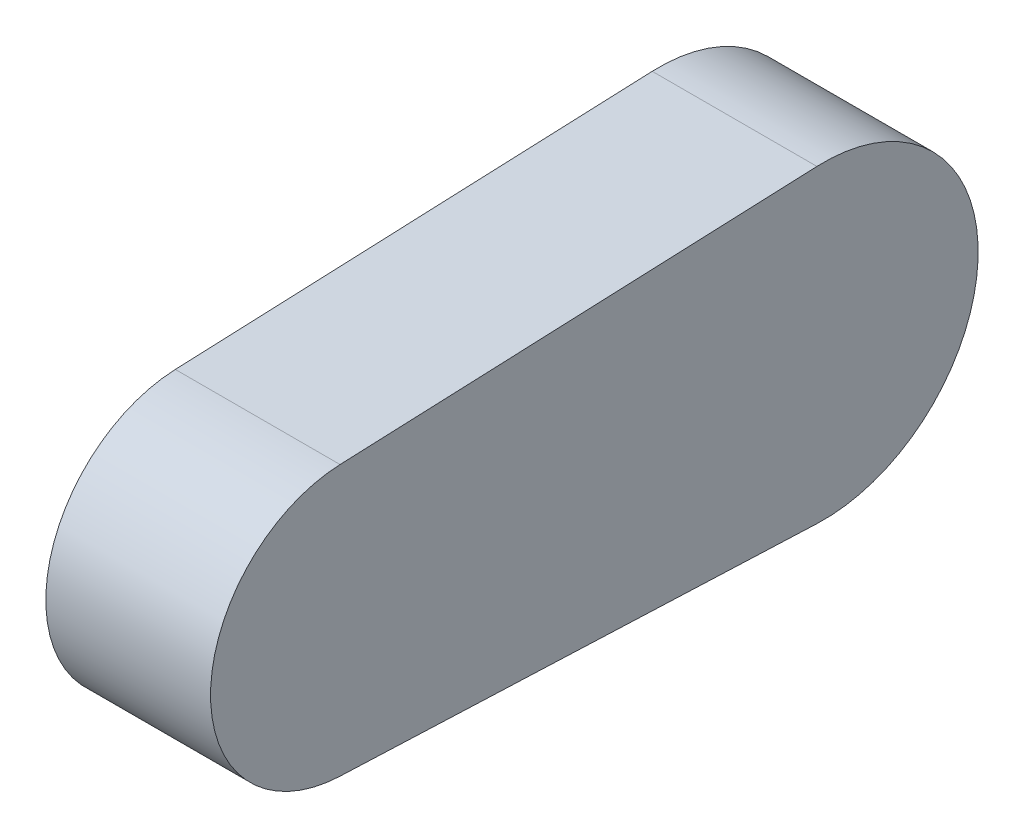
ISO-10303-21;
HEADER;
FILE_DESCRIPTION(('STEP AP214'),'2;1');
FILE_NAME('part.step','',(''),(''),'','','');
FILE_SCHEMA(('AUTOMOTIVE_DESIGN { 1 0 10303 214 1 1 1 1 }'));
ENDSEC;
DATA;
#1=APPLICATION_CONTEXT('core data for automotive mechanical design processes');
#2=APPLICATION_PROTOCOL_DEFINITION('international standard','automotive_design',2000,#1);
#3=PRODUCT_CONTEXT('',#1,'mechanical');
#4=PRODUCT('Part','Part','',(#3));
#5=PRODUCT_RELATED_PRODUCT_CATEGORY('part','',(#4));
#6=PRODUCT_DEFINITION_FORMATION('','',#4);
#7=PRODUCT_DEFINITION_CONTEXT('part definition',#1,'design');
#8=PRODUCT_DEFINITION('design','',#6,#7);
#9=PRODUCT_DEFINITION_SHAPE('','',#8);
#10=(LENGTH_UNIT() NAMED_UNIT(*) SI_UNIT(.MILLI.,.METRE.));
#11=(NAMED_UNIT(*) PLANE_ANGLE_UNIT() SI_UNIT($,.RADIAN.));
#12=(NAMED_UNIT(*) SI_UNIT($,.STERADIAN.) SOLID_ANGLE_UNIT());
#13=UNCERTAINTY_MEASURE_WITH_UNIT(LENGTH_MEASURE(1.E-05),#10,'distance_accuracy_value','');
#14=(GEOMETRIC_REPRESENTATION_CONTEXT(3) GLOBAL_UNCERTAINTY_ASSIGNED_CONTEXT((#13)) GLOBAL_UNIT_ASSIGNED_CONTEXT((#10,
#11,#12)) REPRESENTATION_CONTEXT('',''));
#15=CARTESIAN_POINT('',(0.,0.,0.));
#16=DIRECTION('',(0.,0.,1.));
#17=DIRECTION('',(1.,0.,0.));
#18=AXIS2_PLACEMENT_3D('',#15,#16,#17);
#19=CARTESIAN_POINT('',(197.5,-5.32213162429684E-12,631.));
#20=DIRECTION('',(-1.,0.,0.));
#21=DIRECTION('',(0.,0.,1.));
#22=AXIS2_PLACEMENT_3D('',#19,#20,#21);
#23=CYLINDRICAL_SURFACE('',#22,82.);
#24=CARTESIAN_POINT('',(97.5,-5.32213162429684E-12,631.));
#25=DIRECTION('',(1.,0.,0.));
#26=DIRECTION('',(0.,0.,-1.));
#27=AXIS2_PLACEMENT_3D('',#24,#25,#26);
#28=CIRCLE('',#27,82.);
#29=CARTESIAN_POINT('',(97.5,81.9297677830793,634.393103448276));
#30=VERTEX_POINT('',#29);
#31=CARTESIAN_POINT('',(97.5,-81.9297677830793,634.393103448276));
#32=VERTEX_POINT('',#31);
#33=EDGE_CURVE('E104',#30,#32,#28,.T.);
#34=ORIENTED_EDGE('',*,*,#33,.T.);
#35=DIRECTION('',(-1.,0.,0.));
#36=VECTOR('',#35,1.);
#37=CARTESIAN_POINT('',(197.5,-81.9297677830793,634.393103448276));
#38=LINE('',#37,#36);
#39=CARTESIAN_POINT('',(197.5,-81.9297677830793,634.393103448276));
#40=VERTEX_POINT('',#39);
#41=EDGE_CURVE('E11',#40,#32,#38,.T.);
#42=ORIENTED_EDGE('',*,*,#41,.F.);
#43=CARTESIAN_POINT('',(197.5,-5.32213162429684E-12,631.));
#44=DIRECTION('',(1.,0.,0.));
#45=DIRECTION('',(0.,0.,-1.));
#46=AXIS2_PLACEMENT_3D('',#43,#44,#45);
#47=CIRCLE('',#46,82.);
#48=CARTESIAN_POINT('',(197.5,81.9297677830793,634.393103448276));
#49=VERTEX_POINT('',#48);
#50=EDGE_CURVE('E69',#49,#40,#47,.T.);
#51=ORIENTED_EDGE('',*,*,#50,.F.);
#52=DIRECTION('',(-1.,0.,0.));
#53=VECTOR('',#52,1.);
#54=CARTESIAN_POINT('',(197.5,81.9297677830793,634.393103448276));
#55=LINE('',#54,#53);
#56=EDGE_CURVE('E80',#49,#30,#55,.T.);
#57=ORIENTED_EDGE('',*,*,#56,.T.);
#58=EDGE_LOOP('',(#34,#42,#51,#57));
#59=FACE_BOUND('',#58,.T.);
#60=ADVANCED_FACE('F17',(#59),#23,.T.);
#61=CARTESIAN_POINT('',(197.5,-87.9246288403778,489.641379310345));
#62=DIRECTION('',(0.,-0.999143509549748,0.0413793103448276));
#63=DIRECTION('',(0.,-0.0413793103448276,-0.999143509549748));
#64=AXIS2_PLACEMENT_3D('',#61,#62,#63);
#65=PLANE('',#64);
#66=DIRECTION('',(0.,0.0413793103448276,0.999143509549748));
#67=VECTOR('',#66,1.);
#68=CARTESIAN_POINT('',(97.5,-87.9246288403778,489.641379310345));
#69=LINE('',#68,#67);
#70=CARTESIAN_POINT('',(97.5,-93.9194898976763,344.889655172414));
#71=VERTEX_POINT('',#70);
#72=EDGE_CURVE('E106',#71,#32,#69,.T.);
#73=ORIENTED_EDGE('',*,*,#72,.F.);
#74=DIRECTION('',(-1.,0.,0.));
#75=VECTOR('',#74,1.);
#76=CARTESIAN_POINT('',(197.5,-93.9194898976763,344.889655172414));
#77=LINE('',#76,#75);
#78=CARTESIAN_POINT('',(197.5,-93.9194898976763,344.889655172414));
#79=VERTEX_POINT('',#78);
#80=EDGE_CURVE('E26',#79,#71,#77,.T.);
#81=ORIENTED_EDGE('',*,*,#80,.F.);
#82=DIRECTION('',(0.,0.0413793103448276,0.999143509549748));
#83=VECTOR('',#82,1.);
#84=CARTESIAN_POINT('',(197.5,-87.9246288403778,489.641379310345));
#85=LINE('',#84,#83);
#86=EDGE_CURVE('E91',#79,#40,#85,.T.);
#87=ORIENTED_EDGE('',*,*,#86,.T.);
#88=ORIENTED_EDGE('',*,*,#41,.T.);
#89=EDGE_LOOP('',(#73,#81,#87,#88));
#90=FACE_BOUND('',#89,.T.);
#91=ADVANCED_FACE('F132',(#90),#65,.T.);
#92=CARTESIAN_POINT('',(197.5,0.,341.));
#93=DIRECTION('',(-1.,0.,0.));
#94=DIRECTION('',(0.,0.,1.));
#95=AXIS2_PLACEMENT_3D('',#92,#93,#94);
#96=CYLINDRICAL_SURFACE('',#95,94.);
#97=CARTESIAN_POINT('',(97.5,0.,341.));
#98=DIRECTION('',(-1.,0.,0.));
#99=DIRECTION('',(0.,0.,-1.));
#100=AXIS2_PLACEMENT_3D('',#97,#98,#99);
#101=CIRCLE('',#100,94.);
#102=CARTESIAN_POINT('',(97.5,93.9194898976763,344.889655172414));
#103=VERTEX_POINT('',#102);
#104=EDGE_CURVE('E99',#103,#71,#101,.T.);
#105=ORIENTED_EDGE('',*,*,#104,.F.);
#106=DIRECTION('',(-1.,0.,0.));
#107=VECTOR('',#106,1.);
#108=CARTESIAN_POINT('',(197.5,93.9194898976763,344.889655172414));
#109=LINE('',#108,#107);
#110=CARTESIAN_POINT('',(197.5,93.9194898976763,344.889655172414));
#111=VERTEX_POINT('',#110);
#112=EDGE_CURVE('E39',#111,#103,#109,.T.);
#113=ORIENTED_EDGE('',*,*,#112,.F.);
#114=CARTESIAN_POINT('',(197.5,0.,341.));
#115=DIRECTION('',(-1.,0.,0.));
#116=DIRECTION('',(0.,0.,-1.));
#117=AXIS2_PLACEMENT_3D('',#114,#115,#116);
#118=CIRCLE('',#117,94.);
#119=EDGE_CURVE('E78',#111,#79,#118,.T.);
#120=ORIENTED_EDGE('',*,*,#119,.T.);
#121=ORIENTED_EDGE('',*,*,#80,.T.);
#122=EDGE_LOOP('',(#105,#113,#120,#121));
#123=FACE_BOUND('',#122,.T.);
#124=ADVANCED_FACE('F130',(#123),#96,.T.);
#125=CARTESIAN_POINT('',(197.5,87.9246288403778,489.641379310345));
#126=DIRECTION('',(0.,-0.999143509549748,-0.0413793103448276));
#127=DIRECTION('',(0.,0.0413793103448276,-0.999143509549748));
#128=AXIS2_PLACEMENT_3D('',#125,#126,#127);
#129=PLANE('',#128);
#130=DIRECTION('',(0.,-0.0413793103448276,0.999143509549748));
#131=VECTOR('',#130,1.);
#132=CARTESIAN_POINT('',(97.5,87.9246288403778,489.641379310345));
#133=LINE('',#132,#131);
#134=EDGE_CURVE('E84',#103,#30,#133,.T.);
#135=ORIENTED_EDGE('',*,*,#134,.T.);
#136=ORIENTED_EDGE('',*,*,#56,.F.);
#137=DIRECTION('',(0.,-0.0413793103448276,0.999143509549748));
#138=VECTOR('',#137,1.);
#139=CARTESIAN_POINT('',(197.5,87.9246288403778,489.641379310345));
#140=LINE('',#139,#138);
#141=EDGE_CURVE('E75',#111,#49,#140,.T.);
#142=ORIENTED_EDGE('',*,*,#141,.F.);
#143=ORIENTED_EDGE('',*,*,#112,.T.);
#144=EDGE_LOOP('',(#135,#136,#142,#143));
#145=FACE_BOUND('',#144,.T.);
#146=ADVANCED_FACE('F83',(#145),#129,.F.);
#147=CARTESIAN_POINT('',(197.5,0.,480.));
#148=DIRECTION('',(1.,0.,0.));
#149=DIRECTION('',(0.,1.,0.));
#150=AXIS2_PLACEMENT_3D('',#147,#148,#149);
#151=PLANE('',#150);
#152=ORIENTED_EDGE('',*,*,#50,.T.);
#153=ORIENTED_EDGE('',*,*,#86,.F.);
#154=ORIENTED_EDGE('',*,*,#119,.F.);
#155=ORIENTED_EDGE('',*,*,#141,.T.);
#156=EDGE_LOOP('',(#152,#153,#154,#155));
#157=FACE_BOUND('',#156,.T.);
#158=ADVANCED_FACE('F77',(#157),#151,.T.);
#159=CARTESIAN_POINT('',(97.5,0.,480.));
#160=DIRECTION('',(1.,0.,0.));
#161=DIRECTION('',(0.,1.,0.));
#162=AXIS2_PLACEMENT_3D('',#159,#160,#161);
#163=PLANE('',#162);
#164=ORIENTED_EDGE('',*,*,#33,.F.);
#165=ORIENTED_EDGE('',*,*,#134,.F.);
#166=ORIENTED_EDGE('',*,*,#104,.T.);
#167=ORIENTED_EDGE('',*,*,#72,.T.);
#168=EDGE_LOOP('',(#164,#165,#166,#167));
#169=FACE_BOUND('',#168,.T.);
#170=ADVANCED_FACE('F129',(#169),#163,.F.);
#171=CLOSED_SHELL('',(#60,#91,#124,#146,#158,#170));
#172=MANIFOLD_SOLID_BREP('B1',#171);
#173=ADVANCED_BREP_SHAPE_REPRESENTATION('',(#18,#172),#14);
#174=SHAPE_DEFINITION_REPRESENTATION(#9,#173);
ENDSEC;
END-ISO-10303-21;
